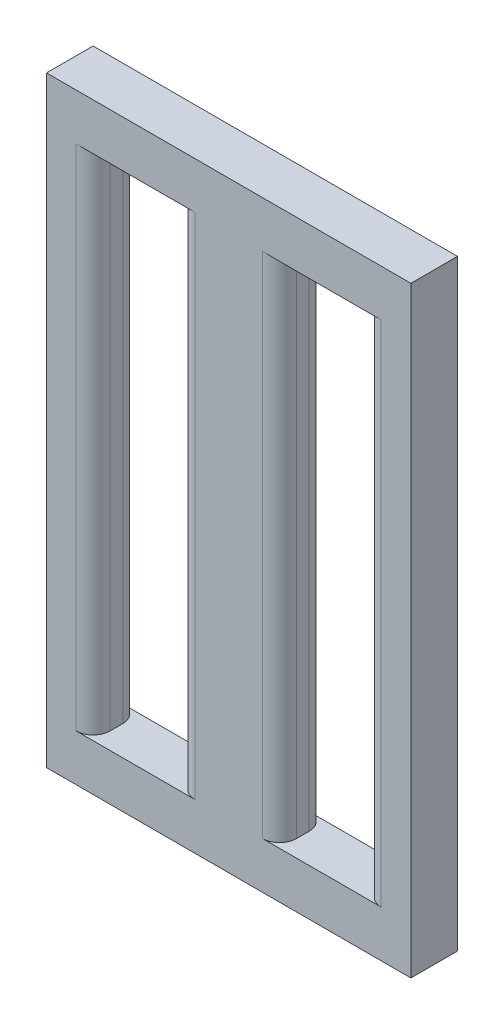
ISO-10303-21;
HEADER;
FILE_DESCRIPTION(('STEP AP214'),'2;1');
FILE_NAME('part.step','',(''),(''),'','','');
FILE_SCHEMA(('AUTOMOTIVE_DESIGN { 1 0 10303 214 1 1 1 1 }'));
ENDSEC;
DATA;
#1=APPLICATION_CONTEXT('core data for automotive mechanical design processes');
#2=APPLICATION_PROTOCOL_DEFINITION('international standard','automotive_design',2000,#1);
#3=PRODUCT_CONTEXT('',#1,'mechanical');
#4=PRODUCT('Part','Part','',(#3));
#5=PRODUCT_RELATED_PRODUCT_CATEGORY('part','',(#4));
#6=PRODUCT_DEFINITION_FORMATION('','',#4);
#7=PRODUCT_DEFINITION_CONTEXT('part definition',#1,'design');
#8=PRODUCT_DEFINITION('design','',#6,#7);
#9=PRODUCT_DEFINITION_SHAPE('','',#8);
#10=(LENGTH_UNIT() NAMED_UNIT(*) SI_UNIT(.MILLI.,.METRE.));
#11=(NAMED_UNIT(*) PLANE_ANGLE_UNIT() SI_UNIT($,.RADIAN.));
#12=(NAMED_UNIT(*) SI_UNIT($,.STERADIAN.) SOLID_ANGLE_UNIT());
#13=UNCERTAINTY_MEASURE_WITH_UNIT(LENGTH_MEASURE(1.E-05),#10,'distance_accuracy_value','');
#14=(GEOMETRIC_REPRESENTATION_CONTEXT(3) GLOBAL_UNCERTAINTY_ASSIGNED_CONTEXT((#13)) GLOBAL_UNIT_ASSIGNED_CONTEXT((#10,
#11,#12)) REPRESENTATION_CONTEXT('',''));
#15=CARTESIAN_POINT('',(0.,0.,0.));
#16=DIRECTION('',(0.,0.,1.));
#17=DIRECTION('',(1.,0.,0.));
#18=AXIS2_PLACEMENT_3D('',#15,#16,#17);
#19=CARTESIAN_POINT('',(0.,0.,2.75));
#20=DIRECTION('',(0.,0.,1.));
#21=DIRECTION('',(1.,0.,0.));
#22=AXIS2_PLACEMENT_3D('',#19,#20,#21);
#23=PLANE('',#22);
#24=DIRECTION('',(1.,0.,0.));
#25=VECTOR('',#24,1.);
#26=CARTESIAN_POINT('',(2.75,0.,2.75));
#27=LINE('',#26,#25);
#28=CARTESIAN_POINT('',(1.75,0.,2.75));
#29=VERTEX_POINT('',#28);
#30=CARTESIAN_POINT('',(8.75,0.,2.75));
#31=VERTEX_POINT('',#30);
#32=EDGE_CURVE('E286',#29,#31,#27,.T.);
#33=ORIENTED_EDGE('',*,*,#32,.F.);
#34=DIRECTION('',(0.,-1.,0.));
#35=VECTOR('',#34,1.);
#36=CARTESIAN_POINT('',(1.75,0.,2.75));
#37=LINE('',#36,#35);
#38=CARTESIAN_POINT('',(1.75,30.,2.75));
#39=VERTEX_POINT('',#38);
#40=EDGE_CURVE('E214',#29,#39,#37,.F.);
#41=ORIENTED_EDGE('',*,*,#40,.T.);
#42=DIRECTION('',(-1.,0.,0.));
#43=VECTOR('',#42,1.);
#44=CARTESIAN_POINT('',(2.75,30.,2.75));
#45=LINE('',#44,#43);
#46=CARTESIAN_POINT('',(8.75,30.,2.75));
#47=VERTEX_POINT('',#46);
#48=EDGE_CURVE('E279',#47,#39,#45,.T.);
#49=ORIENTED_EDGE('',*,*,#48,.F.);
#50=DIRECTION('',(0.,1.,0.));
#51=VECTOR('',#50,1.);
#52=CARTESIAN_POINT('',(8.75,0.,2.75));
#53=LINE('',#52,#51);
#54=EDGE_CURVE('E205',#47,#31,#53,.F.);
#55=ORIENTED_EDGE('',*,*,#54,.T.);
#56=EDGE_LOOP('',(#33,#41,#49,#55));
#57=FACE_BOUND('',#56,.T.);
#58=DIRECTION('',(0.,-1.,0.));
#59=VECTOR('',#58,1.);
#60=CARTESIAN_POINT('',(0.,0.,2.75));
#61=LINE('',#60,#59);
#62=CARTESIAN_POINT('',(0.,32.75,2.75));
#63=VERTEX_POINT('',#62);
#64=CARTESIAN_POINT('',(0.,-2.75,2.75));
#65=VERTEX_POINT('',#64);
#66=EDGE_CURVE('E182',#63,#65,#61,.T.);
#67=ORIENTED_EDGE('',*,*,#66,.T.);
#68=DIRECTION('',(1.,0.,0.));
#69=VECTOR('',#68,1.);
#70=CARTESIAN_POINT('',(0.,-2.75,2.75));
#71=LINE('',#70,#69);
#72=CARTESIAN_POINT('',(21.5,-2.75,2.75));
#73=VERTEX_POINT('',#72);
#74=EDGE_CURVE('E171',#65,#73,#71,.T.);
#75=ORIENTED_EDGE('',*,*,#74,.T.);
#76=DIRECTION('',(0.,1.,0.));
#77=VECTOR('',#76,1.);
#78=CARTESIAN_POINT('',(21.5,-2.75,2.75));
#79=LINE('',#78,#77);
#80=CARTESIAN_POINT('',(21.5,32.75,2.75));
#81=VERTEX_POINT('',#80);
#82=EDGE_CURVE('E181',#73,#81,#79,.T.);
#83=ORIENTED_EDGE('',*,*,#82,.T.);
#84=DIRECTION('',(-1.,0.,0.));
#85=VECTOR('',#84,1.);
#86=CARTESIAN_POINT('',(0.,32.75,2.75));
#87=LINE('',#86,#85);
#88=EDGE_CURVE('E187',#81,#63,#87,.T.);
#89=ORIENTED_EDGE('',*,*,#88,.T.);
#90=EDGE_LOOP('',(#67,#75,#83,#89));
#91=FACE_BOUND('',#90,.T.);
#92=DIRECTION('',(-1.,0.,0.));
#93=VECTOR('',#92,1.);
#94=CARTESIAN_POINT('',(13.75,30.,2.75));
#95=LINE('',#94,#93);
#96=CARTESIAN_POINT('',(19.75,30.,2.75));
#97=VERTEX_POINT('',#96);
#98=CARTESIAN_POINT('',(12.75,30.,2.75));
#99=VERTEX_POINT('',#98);
#100=EDGE_CURVE('E405',#97,#99,#95,.T.);
#101=ORIENTED_EDGE('',*,*,#100,.F.);
#102=DIRECTION('',(0.,1.,0.));
#103=VECTOR('',#102,1.);
#104=CARTESIAN_POINT('',(19.75,0.,2.75));
#105=LINE('',#104,#103);
#106=CARTESIAN_POINT('',(19.75,0.,2.75));
#107=VERTEX_POINT('',#106);
#108=EDGE_CURVE('E211',#97,#107,#105,.F.);
#109=ORIENTED_EDGE('',*,*,#108,.T.);
#110=DIRECTION('',(1.,0.,0.));
#111=VECTOR('',#110,1.);
#112=CARTESIAN_POINT('',(13.75,0.,2.75));
#113=LINE('',#112,#111);
#114=CARTESIAN_POINT('',(12.75,0.,2.75));
#115=VERTEX_POINT('',#114);
#116=EDGE_CURVE('E407',#115,#107,#113,.T.);
#117=ORIENTED_EDGE('',*,*,#116,.F.);
#118=DIRECTION('',(0.,-1.,0.));
#119=VECTOR('',#118,1.);
#120=CARTESIAN_POINT('',(12.75,0.,2.75));
#121=LINE('',#120,#119);
#122=EDGE_CURVE('E208',#115,#99,#121,.F.);
#123=ORIENTED_EDGE('',*,*,#122,.T.);
#124=EDGE_LOOP('',(#101,#109,#117,#123));
#125=FACE_BOUND('',#124,.T.);
#126=ADVANCED_FACE('F32',(#57,#91,#125),#23,.T.);
#127=CARTESIAN_POINT('',(0.,0.,0.));
#128=DIRECTION('',(0.,0.,1.));
#129=DIRECTION('',(1.,0.,0.));
#130=AXIS2_PLACEMENT_3D('',#127,#128,#129);
#131=PLANE('',#130);
#132=DIRECTION('',(0.,-1.,0.));
#133=VECTOR('',#132,1.);
#134=CARTESIAN_POINT('',(1.75,0.,0.));
#135=LINE('',#134,#133);
#136=CARTESIAN_POINT('',(1.75,30.,0.));
#137=VERTEX_POINT('',#136);
#138=CARTESIAN_POINT('',(1.75,0.,0.));
#139=VERTEX_POINT('',#138);
#140=EDGE_CURVE('E226',#137,#139,#135,.T.);
#141=ORIENTED_EDGE('',*,*,#140,.T.);
#142=DIRECTION('',(1.,0.,0.));
#143=VECTOR('',#142,1.);
#144=CARTESIAN_POINT('',(2.75,0.,0.));
#145=LINE('',#144,#143);
#146=CARTESIAN_POINT('',(8.75,0.,0.));
#147=VERTEX_POINT('',#146);
#148=EDGE_CURVE('E289',#139,#147,#145,.T.);
#149=ORIENTED_EDGE('',*,*,#148,.T.);
#150=DIRECTION('',(0.,1.,0.));
#151=VECTOR('',#150,1.);
#152=CARTESIAN_POINT('',(8.75,30.,0.));
#153=LINE('',#152,#151);
#154=CARTESIAN_POINT('',(8.75,30.,0.));
#155=VERTEX_POINT('',#154);
#156=EDGE_CURVE('E220',#147,#155,#153,.T.);
#157=ORIENTED_EDGE('',*,*,#156,.T.);
#158=DIRECTION('',(-1.,0.,0.));
#159=VECTOR('',#158,1.);
#160=CARTESIAN_POINT('',(2.75,30.,0.));
#161=LINE('',#160,#159);
#162=EDGE_CURVE('E292',#155,#137,#161,.T.);
#163=ORIENTED_EDGE('',*,*,#162,.T.);
#164=EDGE_LOOP('',(#141,#149,#157,#163));
#165=FACE_BOUND('',#164,.T.);
#166=DIRECTION('',(1.,0.,0.));
#167=VECTOR('',#166,1.);
#168=CARTESIAN_POINT('',(0.,-2.75,0.));
#169=LINE('',#168,#167);
#170=CARTESIAN_POINT('',(0.,-2.75,0.));
#171=VERTEX_POINT('',#170);
#172=CARTESIAN_POINT('',(21.5,-2.75,0.));
#173=VERTEX_POINT('',#172);
#174=EDGE_CURVE('E308',#171,#173,#169,.T.);
#175=ORIENTED_EDGE('',*,*,#174,.F.);
#176=DIRECTION('',(0.,-1.,0.));
#177=VECTOR('',#176,1.);
#178=CARTESIAN_POINT('',(0.,0.,0.));
#179=LINE('',#178,#177);
#180=CARTESIAN_POINT('',(0.,32.75,0.));
#181=VERTEX_POINT('',#180);
#182=EDGE_CURVE('E191',#181,#171,#179,.T.);
#183=ORIENTED_EDGE('',*,*,#182,.F.);
#184=DIRECTION('',(-1.,0.,0.));
#185=VECTOR('',#184,1.);
#186=CARTESIAN_POINT('',(0.,32.75,0.));
#187=LINE('',#186,#185);
#188=CARTESIAN_POINT('',(21.5,32.75,0.));
#189=VERTEX_POINT('',#188);
#190=EDGE_CURVE('E316',#189,#181,#187,.T.);
#191=ORIENTED_EDGE('',*,*,#190,.F.);
#192=DIRECTION('',(0.,1.,0.));
#193=VECTOR('',#192,1.);
#194=CARTESIAN_POINT('',(21.5,32.75,0.));
#195=LINE('',#194,#193);
#196=EDGE_CURVE('E314',#173,#189,#195,.T.);
#197=ORIENTED_EDGE('',*,*,#196,.F.);
#198=EDGE_LOOP('',(#175,#183,#191,#197));
#199=FACE_BOUND('',#198,.T.);
#200=DIRECTION('',(0.,1.,0.));
#201=VECTOR('',#200,1.);
#202=CARTESIAN_POINT('',(19.75,30.,0.));
#203=LINE('',#202,#201);
#204=CARTESIAN_POINT('',(19.75,0.,0.));
#205=VERTEX_POINT('',#204);
#206=CARTESIAN_POINT('',(19.75,30.,0.));
#207=VERTEX_POINT('',#206);
#208=EDGE_CURVE('E223',#205,#207,#203,.T.);
#209=ORIENTED_EDGE('',*,*,#208,.T.);
#210=DIRECTION('',(-1.,0.,0.));
#211=VECTOR('',#210,1.);
#212=CARTESIAN_POINT('',(13.75,30.,0.));
#213=LINE('',#212,#211);
#214=CARTESIAN_POINT('',(12.75,30.,0.));
#215=VERTEX_POINT('',#214);
#216=EDGE_CURVE('E421',#207,#215,#213,.T.);
#217=ORIENTED_EDGE('',*,*,#216,.T.);
#218=DIRECTION('',(0.,-1.,0.));
#219=VECTOR('',#218,1.);
#220=CARTESIAN_POINT('',(12.75,0.,0.));
#221=LINE('',#220,#219);
#222=CARTESIAN_POINT('',(12.75,0.,0.));
#223=VERTEX_POINT('',#222);
#224=EDGE_CURVE('E217',#215,#223,#221,.T.);
#225=ORIENTED_EDGE('',*,*,#224,.T.);
#226=DIRECTION('',(1.,0.,0.));
#227=VECTOR('',#226,1.);
#228=CARTESIAN_POINT('',(13.75,0.,0.));
#229=LINE('',#228,#227);
#230=EDGE_CURVE('E411',#223,#205,#229,.T.);
#231=ORIENTED_EDGE('',*,*,#230,.T.);
#232=EDGE_LOOP('',(#209,#217,#225,#231));
#233=FACE_BOUND('',#232,.T.);
#234=ADVANCED_FACE('F327',(#165,#199,#233),#131,.F.);
#235=CARTESIAN_POINT('',(0.,-2.75,2.75));
#236=DIRECTION('',(0.,1.,0.));
#237=DIRECTION('',(-1.,0.,0.));
#238=AXIS2_PLACEMENT_3D('',#235,#236,#237);
#239=PLANE('',#238);
#240=ORIENTED_EDGE('',*,*,#174,.T.);
#241=DIRECTION('',(0.,0.,-1.));
#242=VECTOR('',#241,1.);
#243=CARTESIAN_POINT('',(21.5,-2.75,2.75));
#244=LINE('',#243,#242);
#245=EDGE_CURVE('E178',#73,#173,#244,.T.);
#246=ORIENTED_EDGE('',*,*,#245,.F.);
#247=ORIENTED_EDGE('',*,*,#74,.F.);
#248=DIRECTION('',(0.,0.,-1.));
#249=VECTOR('',#248,1.);
#250=CARTESIAN_POINT('',(0.,-2.75,2.75));
#251=LINE('',#250,#249);
#252=EDGE_CURVE('E176',#65,#171,#251,.T.);
#253=ORIENTED_EDGE('',*,*,#252,.T.);
#254=EDGE_LOOP('',(#240,#246,#247,#253));
#255=FACE_BOUND('',#254,.T.);
#256=ADVANCED_FACE('F174',(#255),#239,.F.);
#257=CARTESIAN_POINT('',(21.5,32.75,2.75));
#258=DIRECTION('',(-1.,0.,0.));
#259=DIRECTION('',(0.,0.,1.));
#260=AXIS2_PLACEMENT_3D('',#257,#258,#259);
#261=PLANE('',#260);
#262=ORIENTED_EDGE('',*,*,#196,.T.);
#263=DIRECTION('',(0.,0.,-1.));
#264=VECTOR('',#263,1.);
#265=CARTESIAN_POINT('',(21.5,32.75,2.75));
#266=LINE('',#265,#264);
#267=EDGE_CURVE('E199',#81,#189,#266,.T.);
#268=ORIENTED_EDGE('',*,*,#267,.F.);
#269=ORIENTED_EDGE('',*,*,#82,.F.);
#270=ORIENTED_EDGE('',*,*,#245,.T.);
#271=EDGE_LOOP('',(#262,#268,#269,#270));
#272=FACE_BOUND('',#271,.T.);
#273=ADVANCED_FACE('F329',(#272),#261,.F.);
#274=CARTESIAN_POINT('',(0.,32.75,2.75));
#275=DIRECTION('',(0.,-1.,0.));
#276=DIRECTION('',(0.,0.,-1.));
#277=AXIS2_PLACEMENT_3D('',#274,#275,#276);
#278=PLANE('',#277);
#279=ORIENTED_EDGE('',*,*,#190,.T.);
#280=DIRECTION('',(0.,0.,-1.));
#281=VECTOR('',#280,1.);
#282=CARTESIAN_POINT('',(0.,32.75,2.75));
#283=LINE('',#282,#281);
#284=EDGE_CURVE('E312',#63,#181,#283,.T.);
#285=ORIENTED_EDGE('',*,*,#284,.F.);
#286=ORIENTED_EDGE('',*,*,#88,.F.);
#287=ORIENTED_EDGE('',*,*,#267,.T.);
#288=EDGE_LOOP('',(#279,#285,#286,#287));
#289=FACE_BOUND('',#288,.T.);
#290=ADVANCED_FACE('F324',(#289),#278,.F.);
#291=CARTESIAN_POINT('',(0.,0.,2.75));
#292=DIRECTION('',(1.,0.,0.));
#293=DIRECTION('',(0.,0.,-1.));
#294=AXIS2_PLACEMENT_3D('',#291,#292,#293);
#295=PLANE('',#294);
#296=ORIENTED_EDGE('',*,*,#182,.T.);
#297=ORIENTED_EDGE('',*,*,#252,.F.);
#298=ORIENTED_EDGE('',*,*,#66,.F.);
#299=ORIENTED_EDGE('',*,*,#284,.T.);
#300=EDGE_LOOP('',(#296,#297,#298,#299));
#301=FACE_BOUND('',#300,.T.);
#302=ADVANCED_FACE('F193',(#301),#295,.F.);
#303=CARTESIAN_POINT('',(2.75,30.,2.75));
#304=DIRECTION('',(0.,-1.,0.));
#305=DIRECTION('',(0.,0.,-1.));
#306=AXIS2_PLACEMENT_3D('',#303,#304,#305);
#307=PLANE('',#306);
#308=ORIENTED_EDGE('',*,*,#162,.F.);
#309=CARTESIAN_POINT('',(8.75,30.,1.));
#310=DIRECTION('',(0.,-1.,0.));
#311=DIRECTION('',(0.,0.,-1.));
#312=AXIS2_PLACEMENT_3D('',#309,#310,#311);
#313=CIRCLE('',#312,1.);
#314=CARTESIAN_POINT('',(7.75,30.,1.));
#315=VERTEX_POINT('',#314);
#316=EDGE_CURVE('E263',#155,#315,#313,.F.);
#317=ORIENTED_EDGE('',*,*,#316,.T.);
#318=DIRECTION('',(0.,0.,-1.));
#319=VECTOR('',#318,1.);
#320=CARTESIAN_POINT('',(7.75,30.,2.75));
#321=LINE('',#320,#319);
#322=CARTESIAN_POINT('',(7.75,30.,1.75));
#323=VERTEX_POINT('',#322);
#324=EDGE_CURVE('E281',#323,#315,#321,.T.);
#325=ORIENTED_EDGE('',*,*,#324,.F.);
#326=CARTESIAN_POINT('',(8.75,30.,1.75));
#327=DIRECTION('',(0.,-1.,0.));
#328=DIRECTION('',(0.,0.,-1.));
#329=AXIS2_PLACEMENT_3D('',#326,#327,#328);
#330=CIRCLE('',#329,1.);
#331=EDGE_CURVE('E40',#323,#47,#330,.F.);
#332=ORIENTED_EDGE('',*,*,#331,.T.);
#333=ORIENTED_EDGE('',*,*,#48,.T.);
#334=CARTESIAN_POINT('',(1.75,30.,1.75));
#335=DIRECTION('',(0.,-1.,0.));
#336=DIRECTION('',(0.,0.,-1.));
#337=AXIS2_PLACEMENT_3D('',#334,#335,#336);
#338=CIRCLE('',#337,1.);
#339=CARTESIAN_POINT('',(2.75,30.,1.75));
#340=VERTEX_POINT('',#339);
#341=EDGE_CURVE('E246',#39,#340,#338,.F.);
#342=ORIENTED_EDGE('',*,*,#341,.T.);
#343=DIRECTION('',(0.,0.,-1.));
#344=VECTOR('',#343,1.);
#345=CARTESIAN_POINT('',(2.75,30.,2.75));
#346=LINE('',#345,#344);
#347=CARTESIAN_POINT('',(2.75,30.,1.));
#348=VERTEX_POINT('',#347);
#349=EDGE_CURVE('E306',#340,#348,#346,.T.);
#350=ORIENTED_EDGE('',*,*,#349,.T.);
#351=CARTESIAN_POINT('',(1.75,30.,1.));
#352=DIRECTION('',(0.,-1.,0.));
#353=DIRECTION('',(0.,0.,-1.));
#354=AXIS2_PLACEMENT_3D('',#351,#352,#353);
#355=CIRCLE('',#354,1.);
#356=EDGE_CURVE('E250',#348,#137,#355,.F.);
#357=ORIENTED_EDGE('',*,*,#356,.T.);
#358=EDGE_LOOP('',(#308,#317,#325,#332,#333,#342,#350,#357));
#359=FACE_BOUND('',#358,.T.);
#360=ADVANCED_FACE('F278',(#359),#307,.T.);
#361=CARTESIAN_POINT('',(2.75,0.,2.75));
#362=DIRECTION('',(1.,0.,0.));
#363=DIRECTION('',(0.,0.,-1.));
#364=AXIS2_PLACEMENT_3D('',#361,#362,#363);
#365=PLANE('',#364);
#366=ORIENTED_EDGE('',*,*,#349,.F.);
#367=DIRECTION('',(0.,-1.,0.));
#368=VECTOR('',#367,1.);
#369=CARTESIAN_POINT('',(2.75,0.,1.75));
#370=LINE('',#369,#368);
#371=CARTESIAN_POINT('',(2.75,0.,1.75));
#372=VERTEX_POINT('',#371);
#373=EDGE_CURVE('E197',#340,#372,#370,.T.);
#374=ORIENTED_EDGE('',*,*,#373,.T.);
#375=DIRECTION('',(0.,0.,-1.));
#376=VECTOR('',#375,1.);
#377=CARTESIAN_POINT('',(2.75,0.,2.75));
#378=LINE('',#377,#376);
#379=CARTESIAN_POINT('',(2.75,0.,1.));
#380=VERTEX_POINT('',#379);
#381=EDGE_CURVE('E303',#372,#380,#378,.T.);
#382=ORIENTED_EDGE('',*,*,#381,.T.);
#383=DIRECTION('',(0.,-1.,0.));
#384=VECTOR('',#383,1.);
#385=CARTESIAN_POINT('',(2.75,30.,1.));
#386=LINE('',#385,#384);
#387=EDGE_CURVE('E195',#380,#348,#386,.F.);
#388=ORIENTED_EDGE('',*,*,#387,.T.);
#389=EDGE_LOOP('',(#366,#374,#382,#388));
#390=FACE_BOUND('',#389,.T.);
#391=ADVANCED_FACE('F352',(#390),#365,.T.);
#392=CARTESIAN_POINT('',(2.75,0.,2.75));
#393=DIRECTION('',(0.,1.,0.));
#394=DIRECTION('',(0.,0.,1.));
#395=AXIS2_PLACEMENT_3D('',#392,#393,#394);
#396=PLANE('',#395);
#397=ORIENTED_EDGE('',*,*,#148,.F.);
#398=CARTESIAN_POINT('',(1.75,0.,1.));
#399=DIRECTION('',(0.,1.,0.));
#400=DIRECTION('',(0.,0.,1.));
#401=AXIS2_PLACEMENT_3D('',#398,#399,#400);
#402=CIRCLE('',#401,1.);
#403=EDGE_CURVE('E248',#139,#380,#402,.F.);
#404=ORIENTED_EDGE('',*,*,#403,.T.);
#405=ORIENTED_EDGE('',*,*,#381,.F.);
#406=CARTESIAN_POINT('',(1.75,0.,1.75));
#407=DIRECTION('',(0.,1.,0.));
#408=DIRECTION('',(0.,0.,1.));
#409=AXIS2_PLACEMENT_3D('',#406,#407,#408);
#410=CIRCLE('',#409,1.);
#411=EDGE_CURVE('E243',#372,#29,#410,.F.);
#412=ORIENTED_EDGE('',*,*,#411,.T.);
#413=ORIENTED_EDGE('',*,*,#32,.T.);
#414=CARTESIAN_POINT('',(8.75,0.,1.75));
#415=DIRECTION('',(0.,1.,0.));
#416=DIRECTION('',(0.,0.,1.));
#417=AXIS2_PLACEMENT_3D('',#414,#415,#416);
#418=CIRCLE('',#417,1.);
#419=CARTESIAN_POINT('',(7.75,0.,1.75));
#420=VERTEX_POINT('',#419);
#421=EDGE_CURVE('E11',#31,#420,#418,.F.);
#422=ORIENTED_EDGE('',*,*,#421,.T.);
#423=DIRECTION('',(0.,0.,-1.));
#424=VECTOR('',#423,1.);
#425=CARTESIAN_POINT('',(7.75,0.,2.75));
#426=LINE('',#425,#424);
#427=CARTESIAN_POINT('',(7.75,0.,1.));
#428=VERTEX_POINT('',#427);
#429=EDGE_CURVE('E300',#420,#428,#426,.T.);
#430=ORIENTED_EDGE('',*,*,#429,.T.);
#431=CARTESIAN_POINT('',(8.75,0.,1.));
#432=DIRECTION('',(0.,1.,0.));
#433=DIRECTION('',(0.,0.,1.));
#434=AXIS2_PLACEMENT_3D('',#431,#432,#433);
#435=CIRCLE('',#434,1.);
#436=EDGE_CURVE('E265',#428,#147,#435,.F.);
#437=ORIENTED_EDGE('',*,*,#436,.T.);
#438=EDGE_LOOP('',(#397,#404,#405,#412,#413,#422,#430,#437));
#439=FACE_BOUND('',#438,.T.);
#440=ADVANCED_FACE('F356',(#439),#396,.T.);
#441=CARTESIAN_POINT('',(7.75,0.,2.75));
#442=DIRECTION('',(-1.,0.,0.));
#443=DIRECTION('',(0.,0.,1.));
#444=AXIS2_PLACEMENT_3D('',#441,#442,#443);
#445=PLANE('',#444);
#446=ORIENTED_EDGE('',*,*,#324,.T.);
#447=DIRECTION('',(0.,1.,0.));
#448=VECTOR('',#447,1.);
#449=CARTESIAN_POINT('',(7.75,0.,1.));
#450=LINE('',#449,#448);
#451=EDGE_CURVE('E237',#315,#428,#450,.F.);
#452=ORIENTED_EDGE('',*,*,#451,.T.);
#453=ORIENTED_EDGE('',*,*,#429,.F.);
#454=DIRECTION('',(0.,1.,0.));
#455=VECTOR('',#454,1.);
#456=CARTESIAN_POINT('',(7.75,0.,1.75));
#457=LINE('',#456,#455);
#458=EDGE_CURVE('E234',#420,#323,#457,.T.);
#459=ORIENTED_EDGE('',*,*,#458,.T.);
#460=EDGE_LOOP('',(#446,#452,#453,#459));
#461=FACE_BOUND('',#460,.T.);
#462=ADVANCED_FACE('F361',(#461),#445,.T.);
#463=CARTESIAN_POINT('',(13.75,30.,2.75));
#464=DIRECTION('',(0.,-1.,0.));
#465=DIRECTION('',(0.,0.,-1.));
#466=AXIS2_PLACEMENT_3D('',#463,#464,#465);
#467=PLANE('',#466);
#468=ORIENTED_EDGE('',*,*,#216,.F.);
#469=CARTESIAN_POINT('',(19.75,30.,1.));
#470=DIRECTION('',(0.,-1.,0.));
#471=DIRECTION('',(0.,0.,-1.));
#472=AXIS2_PLACEMENT_3D('',#469,#470,#471);
#473=CIRCLE('',#472,1.);
#474=CARTESIAN_POINT('',(18.75,30.,1.));
#475=VERTEX_POINT('',#474);
#476=EDGE_CURVE('E258',#207,#475,#473,.F.);
#477=ORIENTED_EDGE('',*,*,#476,.T.);
#478=DIRECTION('',(0.,0.,-1.));
#479=VECTOR('',#478,1.);
#480=CARTESIAN_POINT('',(18.75,30.,2.75));
#481=LINE('',#480,#479);
#482=CARTESIAN_POINT('',(18.75,30.,1.75));
#483=VERTEX_POINT('',#482);
#484=EDGE_CURVE('E399',#483,#475,#481,.T.);
#485=ORIENTED_EDGE('',*,*,#484,.F.);
#486=CARTESIAN_POINT('',(19.75,30.,1.75));
#487=DIRECTION('',(0.,-1.,0.));
#488=DIRECTION('',(0.,0.,-1.));
#489=AXIS2_PLACEMENT_3D('',#486,#487,#488);
#490=CIRCLE('',#489,1.);
#491=EDGE_CURVE('E253',#483,#97,#490,.F.);
#492=ORIENTED_EDGE('',*,*,#491,.T.);
#493=ORIENTED_EDGE('',*,*,#100,.T.);
#494=CARTESIAN_POINT('',(12.75,30.,1.75));
#495=DIRECTION('',(0.,-1.,0.));
#496=DIRECTION('',(0.,0.,-1.));
#497=AXIS2_PLACEMENT_3D('',#494,#495,#496);
#498=CIRCLE('',#497,1.);
#499=CARTESIAN_POINT('',(13.75,30.,1.75));
#500=VERTEX_POINT('',#499);
#501=EDGE_CURVE('E273',#99,#500,#498,.F.);
#502=ORIENTED_EDGE('',*,*,#501,.T.);
#503=DIRECTION('',(0.,0.,-1.));
#504=VECTOR('',#503,1.);
#505=CARTESIAN_POINT('',(13.75,30.,2.75));
#506=LINE('',#505,#504);
#507=CARTESIAN_POINT('',(13.75,30.,1.));
#508=VERTEX_POINT('',#507);
#509=EDGE_CURVE('E295',#500,#508,#506,.T.);
#510=ORIENTED_EDGE('',*,*,#509,.T.);
#511=CARTESIAN_POINT('',(12.75,30.,1.));
#512=DIRECTION('',(0.,-1.,0.));
#513=DIRECTION('',(0.,0.,-1.));
#514=AXIS2_PLACEMENT_3D('',#511,#512,#513);
#515=CIRCLE('',#514,1.);
#516=EDGE_CURVE('E269',#508,#215,#515,.F.);
#517=ORIENTED_EDGE('',*,*,#516,.T.);
#518=EDGE_LOOP('',(#468,#477,#485,#492,#493,#502,#510,#517));
#519=FACE_BOUND('',#518,.T.);
#520=ADVANCED_FACE('F368',(#519),#467,.T.);
#521=CARTESIAN_POINT('',(13.75,0.,2.75));
#522=DIRECTION('',(1.,0.,0.));
#523=DIRECTION('',(0.,0.,-1.));
#524=AXIS2_PLACEMENT_3D('',#521,#522,#523);
#525=PLANE('',#524);
#526=DIRECTION('',(0.,0.,-1.));
#527=VECTOR('',#526,1.);
#528=CARTESIAN_POINT('',(13.75,0.,2.75));
#529=LINE('',#528,#527);
#530=CARTESIAN_POINT('',(13.75,0.,1.75));
#531=VERTEX_POINT('',#530);
#532=CARTESIAN_POINT('',(13.75,0.,1.));
#533=VERTEX_POINT('',#532);
#534=EDGE_CURVE('E398',#531,#533,#529,.T.);
#535=ORIENTED_EDGE('',*,*,#534,.T.);
#536=DIRECTION('',(0.,-1.,0.));
#537=VECTOR('',#536,1.);
#538=CARTESIAN_POINT('',(13.75,30.,1.));
#539=LINE('',#538,#537);
#540=EDGE_CURVE('E241',#533,#508,#539,.F.);
#541=ORIENTED_EDGE('',*,*,#540,.T.);
#542=ORIENTED_EDGE('',*,*,#509,.F.);
#543=DIRECTION('',(0.,-1.,0.));
#544=VECTOR('',#543,1.);
#545=CARTESIAN_POINT('',(13.75,0.,1.75));
#546=LINE('',#545,#544);
#547=EDGE_CURVE('E239',#500,#531,#546,.T.);
#548=ORIENTED_EDGE('',*,*,#547,.T.);
#549=EDGE_LOOP('',(#535,#541,#542,#548));
#550=FACE_BOUND('',#549,.T.);
#551=ADVANCED_FACE('F372',(#550),#525,.T.);
#552=CARTESIAN_POINT('',(13.75,0.,2.75));
#553=DIRECTION('',(0.,1.,0.));
#554=DIRECTION('',(0.,0.,1.));
#555=AXIS2_PLACEMENT_3D('',#552,#553,#554);
#556=PLANE('',#555);
#557=ORIENTED_EDGE('',*,*,#230,.F.);
#558=CARTESIAN_POINT('',(12.75,0.,1.));
#559=DIRECTION('',(0.,1.,0.));
#560=DIRECTION('',(0.,0.,1.));
#561=AXIS2_PLACEMENT_3D('',#558,#559,#560);
#562=CIRCLE('',#561,1.);
#563=EDGE_CURVE('E47',#223,#533,#562,.F.);
#564=ORIENTED_EDGE('',*,*,#563,.T.);
#565=ORIENTED_EDGE('',*,*,#534,.F.);
#566=CARTESIAN_POINT('',(12.75,0.,1.75));
#567=DIRECTION('',(0.,1.,0.));
#568=DIRECTION('',(0.,0.,1.));
#569=AXIS2_PLACEMENT_3D('',#566,#567,#568);
#570=CIRCLE('',#569,1.);
#571=EDGE_CURVE('E55',#531,#115,#570,.F.);
#572=ORIENTED_EDGE('',*,*,#571,.T.);
#573=ORIENTED_EDGE('',*,*,#116,.T.);
#574=CARTESIAN_POINT('',(19.75,0.,1.75));
#575=DIRECTION('',(0.,1.,0.));
#576=DIRECTION('',(0.,0.,1.));
#577=AXIS2_PLACEMENT_3D('',#574,#575,#576);
#578=CIRCLE('',#577,1.);
#579=CARTESIAN_POINT('',(18.75,0.,1.75));
#580=VERTEX_POINT('',#579);
#581=EDGE_CURVE('E256',#107,#580,#578,.F.);
#582=ORIENTED_EDGE('',*,*,#581,.T.);
#583=DIRECTION('',(0.,0.,-1.));
#584=VECTOR('',#583,1.);
#585=CARTESIAN_POINT('',(18.75,0.,2.75));
#586=LINE('',#585,#584);
#587=CARTESIAN_POINT('',(18.75,0.,1.));
#588=VERTEX_POINT('',#587);
#589=EDGE_CURVE('E392',#580,#588,#586,.T.);
#590=ORIENTED_EDGE('',*,*,#589,.T.);
#591=CARTESIAN_POINT('',(19.75,0.,1.));
#592=DIRECTION('',(0.,1.,0.));
#593=DIRECTION('',(0.,0.,1.));
#594=AXIS2_PLACEMENT_3D('',#591,#592,#593);
#595=CIRCLE('',#594,1.);
#596=EDGE_CURVE('E260',#588,#205,#595,.F.);
#597=ORIENTED_EDGE('',*,*,#596,.T.);
#598=EDGE_LOOP('',(#557,#564,#565,#572,#573,#582,#590,#597));
#599=FACE_BOUND('',#598,.T.);
#600=ADVANCED_FACE('F376',(#599),#556,.T.);
#601=CARTESIAN_POINT('',(18.75,0.,2.75));
#602=DIRECTION('',(-1.,0.,0.));
#603=DIRECTION('',(0.,0.,1.));
#604=AXIS2_PLACEMENT_3D('',#601,#602,#603);
#605=PLANE('',#604);
#606=ORIENTED_EDGE('',*,*,#589,.F.);
#607=DIRECTION('',(0.,1.,0.));
#608=VECTOR('',#607,1.);
#609=CARTESIAN_POINT('',(18.75,0.,1.75));
#610=LINE('',#609,#608);
#611=EDGE_CURVE('E231',#580,#483,#610,.T.);
#612=ORIENTED_EDGE('',*,*,#611,.T.);
#613=ORIENTED_EDGE('',*,*,#484,.T.);
#614=DIRECTION('',(0.,1.,0.));
#615=VECTOR('',#614,1.);
#616=CARTESIAN_POINT('',(18.75,0.,1.));
#617=LINE('',#616,#615);
#618=EDGE_CURVE('E229',#475,#588,#617,.F.);
#619=ORIENTED_EDGE('',*,*,#618,.T.);
#620=EDGE_LOOP('',(#606,#612,#613,#619));
#621=FACE_BOUND('',#620,.T.);
#622=ADVANCED_FACE('F380',(#621),#605,.T.);
#623=CARTESIAN_POINT('',(1.75,0.,1.75));
#624=DIRECTION('',(0.,-1.,0.));
#625=DIRECTION('',(0.,0.,-1.));
#626=AXIS2_PLACEMENT_3D('',#623,#624,#625);
#627=CYLINDRICAL_SURFACE('',#626,1.);
#628=ORIENTED_EDGE('',*,*,#341,.F.);
#629=ORIENTED_EDGE('',*,*,#40,.F.);
#630=ORIENTED_EDGE('',*,*,#411,.F.);
#631=ORIENTED_EDGE('',*,*,#373,.F.);
#632=EDGE_LOOP('',(#628,#629,#630,#631));
#633=FACE_BOUND('',#632,.T.);
#634=ADVANCED_FACE('F382',(#633),#627,.T.);
#635=CARTESIAN_POINT('',(1.75,0.,1.));
#636=DIRECTION('',(0.,1.,0.));
#637=DIRECTION('',(0.,0.,1.));
#638=AXIS2_PLACEMENT_3D('',#635,#636,#637);
#639=CYLINDRICAL_SURFACE('',#638,1.);
#640=ORIENTED_EDGE('',*,*,#356,.F.);
#641=ORIENTED_EDGE('',*,*,#387,.F.);
#642=ORIENTED_EDGE('',*,*,#403,.F.);
#643=ORIENTED_EDGE('',*,*,#140,.F.);
#644=EDGE_LOOP('',(#640,#641,#642,#643));
#645=FACE_BOUND('',#644,.T.);
#646=ADVANCED_FACE('F387',(#645),#639,.T.);
#647=CARTESIAN_POINT('',(19.75,0.,1.75));
#648=DIRECTION('',(0.,1.,0.));
#649=DIRECTION('',(0.,0.,1.));
#650=AXIS2_PLACEMENT_3D('',#647,#648,#649);
#651=CYLINDRICAL_SURFACE('',#650,1.);
#652=ORIENTED_EDGE('',*,*,#581,.F.);
#653=ORIENTED_EDGE('',*,*,#108,.F.);
#654=ORIENTED_EDGE('',*,*,#491,.F.);
#655=ORIENTED_EDGE('',*,*,#611,.F.);
#656=EDGE_LOOP('',(#652,#653,#654,#655));
#657=FACE_BOUND('',#656,.T.);
#658=ADVANCED_FACE('F403',(#657),#651,.T.);
#659=CARTESIAN_POINT('',(19.75,0.,1.));
#660=DIRECTION('',(0.,-1.,0.));
#661=DIRECTION('',(0.,0.,-1.));
#662=AXIS2_PLACEMENT_3D('',#659,#660,#661);
#663=CYLINDRICAL_SURFACE('',#662,1.);
#664=ORIENTED_EDGE('',*,*,#596,.F.);
#665=ORIENTED_EDGE('',*,*,#618,.F.);
#666=ORIENTED_EDGE('',*,*,#476,.F.);
#667=ORIENTED_EDGE('',*,*,#208,.F.);
#668=EDGE_LOOP('',(#664,#665,#666,#667));
#669=FACE_BOUND('',#668,.T.);
#670=ADVANCED_FACE('F425',(#669),#663,.T.);
#671=CARTESIAN_POINT('',(8.75,0.,1.));
#672=DIRECTION('',(0.,-1.,0.));
#673=DIRECTION('',(0.,0.,-1.));
#674=AXIS2_PLACEMENT_3D('',#671,#672,#673);
#675=CYLINDRICAL_SURFACE('',#674,1.);
#676=ORIENTED_EDGE('',*,*,#436,.F.);
#677=ORIENTED_EDGE('',*,*,#451,.F.);
#678=ORIENTED_EDGE('',*,*,#316,.F.);
#679=ORIENTED_EDGE('',*,*,#156,.F.);
#680=EDGE_LOOP('',(#676,#677,#678,#679));
#681=FACE_BOUND('',#680,.T.);
#682=ADVANCED_FACE('F427',(#681),#675,.T.);
#683=CARTESIAN_POINT('',(12.75,0.,1.));
#684=DIRECTION('',(0.,1.,0.));
#685=DIRECTION('',(0.,0.,1.));
#686=AXIS2_PLACEMENT_3D('',#683,#684,#685);
#687=CYLINDRICAL_SURFACE('',#686,1.);
#688=ORIENTED_EDGE('',*,*,#516,.F.);
#689=ORIENTED_EDGE('',*,*,#540,.F.);
#690=ORIENTED_EDGE('',*,*,#563,.F.);
#691=ORIENTED_EDGE('',*,*,#224,.F.);
#692=EDGE_LOOP('',(#688,#689,#690,#691));
#693=FACE_BOUND('',#692,.T.);
#694=ADVANCED_FACE('F420',(#693),#687,.T.);
#695=CARTESIAN_POINT('',(12.75,0.,1.75));
#696=DIRECTION('',(0.,-1.,0.));
#697=DIRECTION('',(0.,0.,-1.));
#698=AXIS2_PLACEMENT_3D('',#695,#696,#697);
#699=CYLINDRICAL_SURFACE('',#698,1.);
#700=ORIENTED_EDGE('',*,*,#501,.F.);
#701=ORIENTED_EDGE('',*,*,#122,.F.);
#702=ORIENTED_EDGE('',*,*,#571,.F.);
#703=ORIENTED_EDGE('',*,*,#547,.F.);
#704=EDGE_LOOP('',(#700,#701,#702,#703));
#705=FACE_BOUND('',#704,.T.);
#706=ADVANCED_FACE('F439',(#705),#699,.T.);
#707=CARTESIAN_POINT('',(8.75,0.,1.75));
#708=DIRECTION('',(0.,1.,0.));
#709=DIRECTION('',(0.,0.,1.));
#710=AXIS2_PLACEMENT_3D('',#707,#708,#709);
#711=CYLINDRICAL_SURFACE('',#710,1.);
#712=ORIENTED_EDGE('',*,*,#421,.F.);
#713=ORIENTED_EDGE('',*,*,#54,.F.);
#714=ORIENTED_EDGE('',*,*,#331,.F.);
#715=ORIENTED_EDGE('',*,*,#458,.F.);
#716=EDGE_LOOP('',(#712,#713,#714,#715));
#717=FACE_BOUND('',#716,.T.);
#718=ADVANCED_FACE('F34',(#717),#711,.T.);
#719=CLOSED_SHELL('',(#126,#234,#256,#273,#290,#302,#360,#391,#440,#462,#520,#551,#600,#622,
#634,#646,#658,#670,#682,#694,#706,#718));
#720=MANIFOLD_SOLID_BREP('B2',#719);
#721=ADVANCED_BREP_SHAPE_REPRESENTATION('',(#18,#720),#14);
#722=SHAPE_DEFINITION_REPRESENTATION(#9,#721);
ENDSEC;
END-ISO-10303-21;
